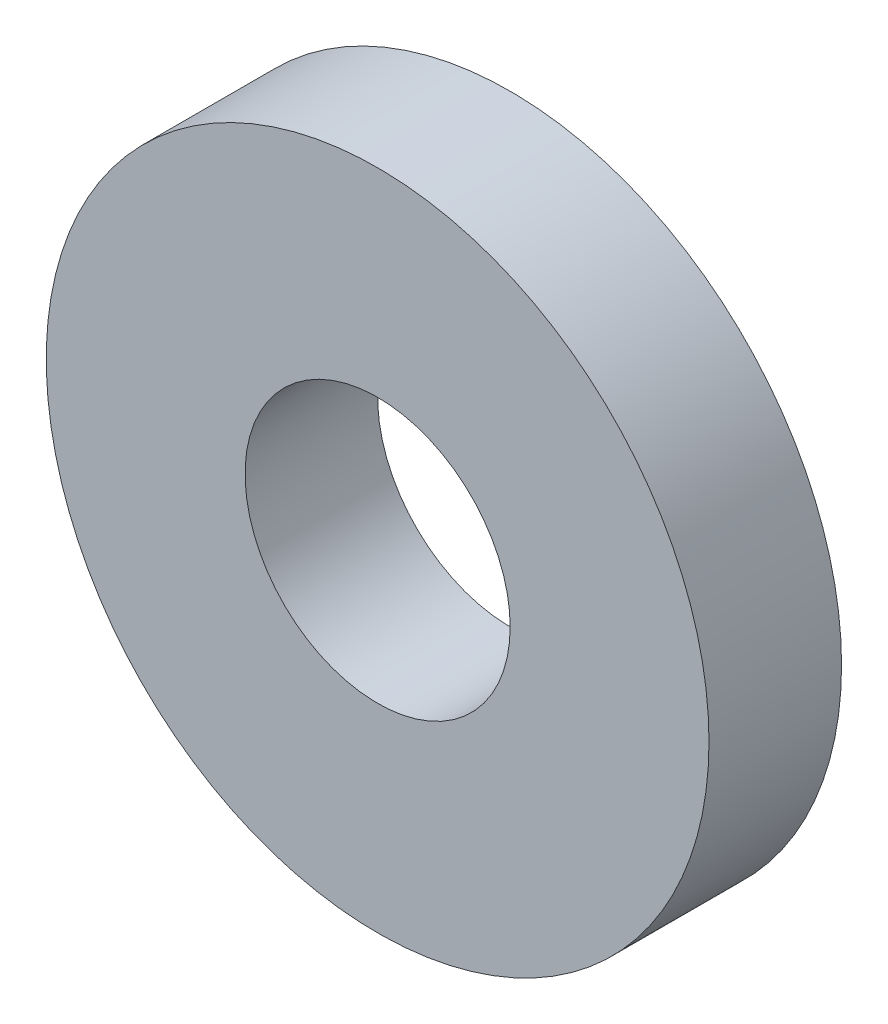
ISO-10303-21;
HEADER;
FILE_DESCRIPTION(('STEP AP214'),'2;1');
FILE_NAME('part.step','',(''),(''),'','','');
FILE_SCHEMA(('AUTOMOTIVE_DESIGN { 1 0 10303 214 1 1 1 1 }'));
ENDSEC;
DATA;
#1=APPLICATION_CONTEXT('core data for automotive mechanical design processes');
#2=APPLICATION_PROTOCOL_DEFINITION('international standard','automotive_design',2000,#1);
#3=PRODUCT_CONTEXT('',#1,'mechanical');
#4=PRODUCT('Part','Part','',(#3));
#5=PRODUCT_RELATED_PRODUCT_CATEGORY('part','',(#4));
#6=PRODUCT_DEFINITION_FORMATION('','',#4);
#7=PRODUCT_DEFINITION_CONTEXT('part definition',#1,'design');
#8=PRODUCT_DEFINITION('design','',#6,#7);
#9=PRODUCT_DEFINITION_SHAPE('','',#8);
#10=(LENGTH_UNIT() NAMED_UNIT(*) SI_UNIT(.MILLI.,.METRE.));
#11=(NAMED_UNIT(*) PLANE_ANGLE_UNIT() SI_UNIT($,.RADIAN.));
#12=(NAMED_UNIT(*) SI_UNIT($,.STERADIAN.) SOLID_ANGLE_UNIT());
#13=UNCERTAINTY_MEASURE_WITH_UNIT(LENGTH_MEASURE(1.E-05),#10,'distance_accuracy_value','');
#14=(GEOMETRIC_REPRESENTATION_CONTEXT(3) GLOBAL_UNCERTAINTY_ASSIGNED_CONTEXT((#13)) GLOBAL_UNIT_ASSIGNED_CONTEXT((#10,
#11,#12)) REPRESENTATION_CONTEXT('',''));
#15=CARTESIAN_POINT('',(0.,0.,0.));
#16=DIRECTION('',(0.,0.,1.));
#17=DIRECTION('',(1.,0.,0.));
#18=AXIS2_PLACEMENT_3D('',#15,#16,#17);
#19=CARTESIAN_POINT('',(0.,92.5,5.));
#20=DIRECTION('',(0.,0.,1.));
#21=DIRECTION('',(1.,0.,0.));
#22=AXIS2_PLACEMENT_3D('',#19,#20,#21);
#23=PLANE('',#22);
#24=CARTESIAN_POINT('',(0.,92.5,5.));
#25=DIRECTION('',(0.,0.,1.));
#26=DIRECTION('',(1.,0.,0.));
#27=AXIS2_PLACEMENT_3D('',#24,#25,#26);
#28=CIRCLE('',#27,12.5);
#29=CARTESIAN_POINT('',(12.5,92.5,5.));
#30=VERTEX_POINT('',#29);
#31=EDGE_CURVE('E10',#30,#30,#28,.T.);
#32=ORIENTED_EDGE('',*,*,#31,.T.);
#33=EDGE_LOOP('',(#32));
#34=FACE_BOUND('',#33,.T.);
#35=CARTESIAN_POINT('',(0.,92.5,5.));
#36=DIRECTION('',(0.,0.,1.));
#37=DIRECTION('',(1.,0.,0.));
#38=AXIS2_PLACEMENT_3D('',#35,#36,#37);
#39=CIRCLE('',#38,5.);
#40=CARTESIAN_POINT('',(5.,92.5,5.));
#41=VERTEX_POINT('',#40);
#42=EDGE_CURVE('E46',#41,#41,#39,.T.);
#43=ORIENTED_EDGE('',*,*,#42,.F.);
#44=EDGE_LOOP('',(#43));
#45=FACE_BOUND('',#44,.T.);
#46=ADVANCED_FACE('F35',(#34,#45),#23,.T.);
#47=CARTESIAN_POINT('',(0.,92.5,0.));
#48=DIRECTION('',(0.,0.,1.));
#49=DIRECTION('',(1.,0.,0.));
#50=AXIS2_PLACEMENT_3D('',#47,#48,#49);
#51=PLANE('',#50);
#52=CARTESIAN_POINT('',(0.,92.5,0.));
#53=DIRECTION('',(0.,0.,1.));
#54=DIRECTION('',(1.,0.,0.));
#55=AXIS2_PLACEMENT_3D('',#52,#53,#54);
#56=CIRCLE('',#55,12.5);
#57=CARTESIAN_POINT('',(12.5,92.5,0.));
#58=VERTEX_POINT('',#57);
#59=EDGE_CURVE('E39',#58,#58,#56,.T.);
#60=ORIENTED_EDGE('',*,*,#59,.F.);
#61=EDGE_LOOP('',(#60));
#62=FACE_BOUND('',#61,.T.);
#63=CARTESIAN_POINT('',(0.,92.5,0.));
#64=DIRECTION('',(0.,0.,1.));
#65=DIRECTION('',(1.,0.,0.));
#66=AXIS2_PLACEMENT_3D('',#63,#64,#65);
#67=CIRCLE('',#66,5.);
#68=CARTESIAN_POINT('',(5.,92.5,0.));
#69=VERTEX_POINT('',#68);
#70=EDGE_CURVE('E48',#69,#69,#67,.T.);
#71=ORIENTED_EDGE('',*,*,#70,.T.);
#72=EDGE_LOOP('',(#71));
#73=FACE_BOUND('',#72,.T.);
#74=ADVANCED_FACE('F58',(#62,#73),#51,.F.);
#75=CARTESIAN_POINT('',(0.,92.5,5.));
#76=DIRECTION('',(0.,0.,-1.));
#77=DIRECTION('',(-1.,0.,0.));
#78=AXIS2_PLACEMENT_3D('',#75,#76,#77);
#79=CYLINDRICAL_SURFACE('',#78,12.5);
#80=ORIENTED_EDGE('',*,*,#31,.F.);
#81=EDGE_LOOP('',(#80));
#82=FACE_BOUND('',#81,.T.);
#83=ORIENTED_EDGE('',*,*,#59,.T.);
#84=EDGE_LOOP('',(#83));
#85=FACE_BOUND('',#84,.T.);
#86=ADVANCED_FACE('F37',(#82,#85),#79,.T.);
#87=CARTESIAN_POINT('',(0.,92.5,5.));
#88=DIRECTION('',(0.,0.,-1.));
#89=DIRECTION('',(-1.,0.,0.));
#90=AXIS2_PLACEMENT_3D('',#87,#88,#89);
#91=CYLINDRICAL_SURFACE('',#90,5.);
#92=ORIENTED_EDGE('',*,*,#42,.T.);
#93=EDGE_LOOP('',(#92));
#94=FACE_BOUND('',#93,.T.);
#95=ORIENTED_EDGE('',*,*,#70,.F.);
#96=EDGE_LOOP('',(#95));
#97=FACE_BOUND('',#96,.T.);
#98=ADVANCED_FACE('F54',(#94,#97),#91,.F.);
#99=CLOSED_SHELL('',(#46,#74,#86,#98));
#100=MANIFOLD_SOLID_BREP('B2',#99);
#101=ADVANCED_BREP_SHAPE_REPRESENTATION('',(#18,#100),#14);
#102=SHAPE_DEFINITION_REPRESENTATION(#9,#101);
ENDSEC;
END-ISO-10303-21;
